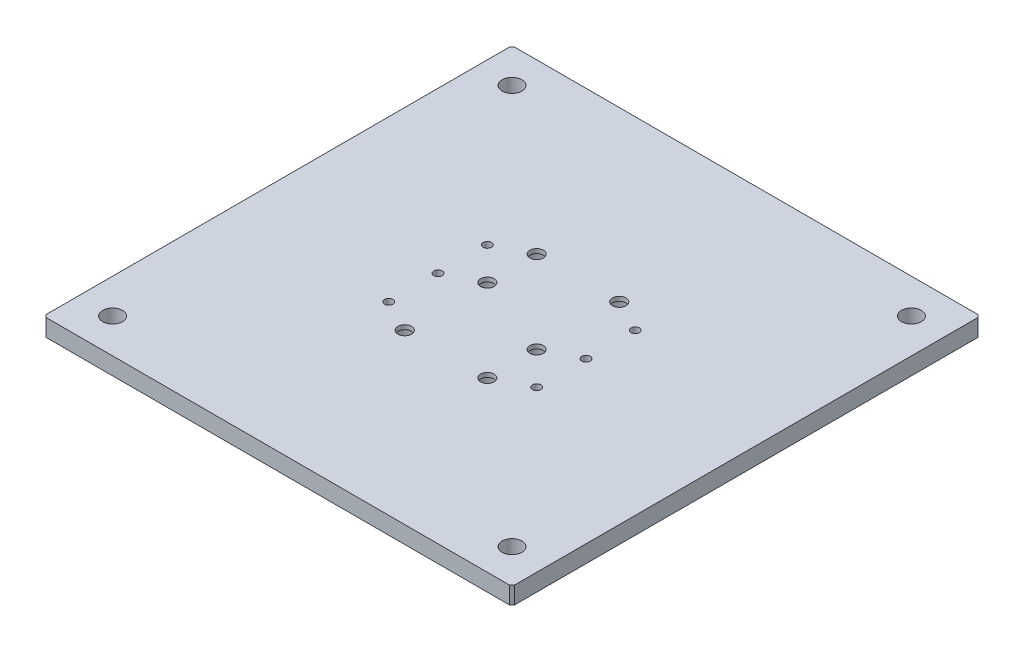
ISO-10303-21;
HEADER;
FILE_DESCRIPTION(('STEP AP214'),'2;1');
FILE_NAME('part.step','',(''),(''),'','','');
FILE_SCHEMA(('AUTOMOTIVE_DESIGN { 1 0 10303 214 1 1 1 1 }'));
ENDSEC;
DATA;
#1=APPLICATION_CONTEXT('core data for automotive mechanical design processes');
#2=APPLICATION_PROTOCOL_DEFINITION('international standard','automotive_design',2000,#1);
#3=PRODUCT_CONTEXT('',#1,'mechanical');
#4=PRODUCT('Part','Part','',(#3));
#5=PRODUCT_RELATED_PRODUCT_CATEGORY('part','',(#4));
#6=PRODUCT_DEFINITION_FORMATION('','',#4);
#7=PRODUCT_DEFINITION_CONTEXT('part definition',#1,'design');
#8=PRODUCT_DEFINITION('design','',#6,#7);
#9=PRODUCT_DEFINITION_SHAPE('','',#8);
#10=(LENGTH_UNIT() NAMED_UNIT(*) SI_UNIT(.MILLI.,.METRE.));
#11=(NAMED_UNIT(*) PLANE_ANGLE_UNIT() SI_UNIT($,.RADIAN.));
#12=(NAMED_UNIT(*) SI_UNIT($,.STERADIAN.) SOLID_ANGLE_UNIT());
#13=UNCERTAINTY_MEASURE_WITH_UNIT(LENGTH_MEASURE(1.E-05),#10,'distance_accuracy_value','');
#14=(GEOMETRIC_REPRESENTATION_CONTEXT(3) GLOBAL_UNCERTAINTY_ASSIGNED_CONTEXT((#13)) GLOBAL_UNIT_ASSIGNED_CONTEXT((#10,
#11,#12)) REPRESENTATION_CONTEXT('',''));
#15=CARTESIAN_POINT('',(0.,0.,0.));
#16=DIRECTION('',(0.,0.,1.));
#17=DIRECTION('',(1.,0.,0.));
#18=AXIS2_PLACEMENT_3D('',#15,#16,#17);
#19=CARTESIAN_POINT('',(-190.,14.,190.));
#20=DIRECTION('',(1.,0.,0.));
#21=DIRECTION('',(0.,0.,-1.));
#22=AXIS2_PLACEMENT_3D('',#19,#20,#21);
#23=PLANE('',#22);
#24=DIRECTION('',(0.,0.,1.));
#25=VECTOR('',#24,1.);
#26=CARTESIAN_POINT('',(-190.,14.,190.));
#27=LINE('',#26,#25);
#28=CARTESIAN_POINT('',(-190.,14.,-188.));
#29=VERTEX_POINT('',#28);
#30=CARTESIAN_POINT('',(-190.,14.,188.));
#31=VERTEX_POINT('',#30);
#32=EDGE_CURVE('E129',#29,#31,#27,.T.);
#33=ORIENTED_EDGE('',*,*,#32,.F.);
#34=DIRECTION('',(0.,-1.,0.));
#35=VECTOR('',#34,1.);
#36=CARTESIAN_POINT('',(-190.,14.,-188.));
#37=LINE('',#36,#35);
#38=CARTESIAN_POINT('',(-190.,0.,-188.));
#39=VERTEX_POINT('',#38);
#40=EDGE_CURVE('E11',#29,#39,#37,.T.);
#41=ORIENTED_EDGE('',*,*,#40,.T.);
#42=DIRECTION('',(0.,0.,1.));
#43=VECTOR('',#42,1.);
#44=CARTESIAN_POINT('',(-190.,0.,190.));
#45=LINE('',#44,#43);
#46=CARTESIAN_POINT('',(-190.,0.,188.));
#47=VERTEX_POINT('',#46);
#48=EDGE_CURVE('E131',#39,#47,#45,.T.);
#49=ORIENTED_EDGE('',*,*,#48,.T.);
#50=DIRECTION('',(0.,1.,0.));
#51=VECTOR('',#50,1.);
#52=CARTESIAN_POINT('',(-190.,14.,188.));
#53=LINE('',#52,#51);
#54=EDGE_CURVE('E42',#47,#31,#53,.T.);
#55=ORIENTED_EDGE('',*,*,#54,.T.);
#56=EDGE_LOOP('',(#33,#41,#49,#55));
#57=FACE_BOUND('',#56,.T.);
#58=ADVANCED_FACE('F34',(#57),#23,.F.);
#59=CARTESIAN_POINT('',(190.,14.,190.));
#60=DIRECTION('',(0.,0.,-1.));
#61=DIRECTION('',(-1.,0.,0.));
#62=AXIS2_PLACEMENT_3D('',#59,#60,#61);
#63=PLANE('',#62);
#64=DIRECTION('',(1.,0.,0.));
#65=VECTOR('',#64,1.);
#66=CARTESIAN_POINT('',(190.,0.,190.));
#67=LINE('',#66,#65);
#68=CARTESIAN_POINT('',(-188.,0.,190.));
#69=VERTEX_POINT('',#68);
#70=CARTESIAN_POINT('',(188.,0.,190.));
#71=VERTEX_POINT('',#70);
#72=EDGE_CURVE('E127',#69,#71,#67,.T.);
#73=ORIENTED_EDGE('',*,*,#72,.T.);
#74=DIRECTION('',(0.,1.,0.));
#75=VECTOR('',#74,1.);
#76=CARTESIAN_POINT('',(188.,14.,190.));
#77=LINE('',#76,#75);
#78=CARTESIAN_POINT('',(188.,14.,190.));
#79=VERTEX_POINT('',#78);
#80=EDGE_CURVE('E106',#71,#79,#77,.T.);
#81=ORIENTED_EDGE('',*,*,#80,.T.);
#82=DIRECTION('',(1.,0.,0.));
#83=VECTOR('',#82,1.);
#84=CARTESIAN_POINT('',(190.,14.,190.));
#85=LINE('',#84,#83);
#86=CARTESIAN_POINT('',(-188.,14.,190.));
#87=VERTEX_POINT('',#86);
#88=EDGE_CURVE('E167',#87,#79,#85,.T.);
#89=ORIENTED_EDGE('',*,*,#88,.F.);
#90=DIRECTION('',(0.,-1.,0.));
#91=VECTOR('',#90,1.);
#92=CARTESIAN_POINT('',(-188.,14.,190.));
#93=LINE('',#92,#91);
#94=EDGE_CURVE('E111',#87,#69,#93,.T.);
#95=ORIENTED_EDGE('',*,*,#94,.T.);
#96=EDGE_LOOP('',(#73,#81,#89,#95));
#97=FACE_BOUND('',#96,.T.);
#98=ADVANCED_FACE('F171',(#97),#63,.F.);
#99=CARTESIAN_POINT('',(190.,14.,190.));
#100=DIRECTION('',(-1.,0.,0.));
#101=DIRECTION('',(0.,0.,1.));
#102=AXIS2_PLACEMENT_3D('',#99,#100,#101);
#103=PLANE('',#102);
#104=DIRECTION('',(0.,0.,-1.));
#105=VECTOR('',#104,1.);
#106=CARTESIAN_POINT('',(190.,14.,190.));
#107=LINE('',#106,#105);
#108=CARTESIAN_POINT('',(190.,14.,188.));
#109=VERTEX_POINT('',#108);
#110=CARTESIAN_POINT('',(190.,14.,-188.));
#111=VERTEX_POINT('',#110);
#112=EDGE_CURVE('E120',#109,#111,#107,.T.);
#113=ORIENTED_EDGE('',*,*,#112,.F.);
#114=DIRECTION('',(0.,-1.,0.));
#115=VECTOR('',#114,1.);
#116=CARTESIAN_POINT('',(190.,14.,188.));
#117=LINE('',#116,#115);
#118=CARTESIAN_POINT('',(190.,0.,188.));
#119=VERTEX_POINT('',#118);
#120=EDGE_CURVE('E105',#109,#119,#117,.T.);
#121=ORIENTED_EDGE('',*,*,#120,.T.);
#122=DIRECTION('',(0.,0.,-1.));
#123=VECTOR('',#122,1.);
#124=CARTESIAN_POINT('',(190.,0.,190.));
#125=LINE('',#124,#123);
#126=CARTESIAN_POINT('',(190.,0.,-188.));
#127=VERTEX_POINT('',#126);
#128=EDGE_CURVE('E118',#119,#127,#125,.T.);
#129=ORIENTED_EDGE('',*,*,#128,.T.);
#130=DIRECTION('',(0.,1.,0.));
#131=VECTOR('',#130,1.);
#132=CARTESIAN_POINT('',(190.,14.,-188.));
#133=LINE('',#132,#131);
#134=EDGE_CURVE('E122',#127,#111,#133,.T.);
#135=ORIENTED_EDGE('',*,*,#134,.T.);
#136=EDGE_LOOP('',(#113,#121,#129,#135));
#137=FACE_BOUND('',#136,.T.);
#138=ADVANCED_FACE('F117',(#137),#103,.F.);
#139=CARTESIAN_POINT('',(190.,14.,-190.));
#140=DIRECTION('',(0.,0.,1.));
#141=DIRECTION('',(1.,0.,0.));
#142=AXIS2_PLACEMENT_3D('',#139,#140,#141);
#143=PLANE('',#142);
#144=DIRECTION('',(-1.,0.,0.));
#145=VECTOR('',#144,1.);
#146=CARTESIAN_POINT('',(190.,14.,-190.));
#147=LINE('',#146,#145);
#148=CARTESIAN_POINT('',(188.,14.,-190.));
#149=VERTEX_POINT('',#148);
#150=CARTESIAN_POINT('',(-188.,14.,-190.));
#151=VERTEX_POINT('',#150);
#152=EDGE_CURVE('E135',#149,#151,#147,.T.);
#153=ORIENTED_EDGE('',*,*,#152,.F.);
#154=DIRECTION('',(0.,-1.,0.));
#155=VECTOR('',#154,1.);
#156=CARTESIAN_POINT('',(188.,14.,-190.));
#157=LINE('',#156,#155);
#158=CARTESIAN_POINT('',(188.,0.,-190.));
#159=VERTEX_POINT('',#158);
#160=EDGE_CURVE('E152',#149,#159,#157,.T.);
#161=ORIENTED_EDGE('',*,*,#160,.T.);
#162=DIRECTION('',(-1.,0.,0.));
#163=VECTOR('',#162,1.);
#164=CARTESIAN_POINT('',(190.,0.,-190.));
#165=LINE('',#164,#163);
#166=CARTESIAN_POINT('',(-188.,0.,-190.));
#167=VERTEX_POINT('',#166);
#168=EDGE_CURVE('E126',#159,#167,#165,.T.);
#169=ORIENTED_EDGE('',*,*,#168,.T.);
#170=DIRECTION('',(0.,1.,0.));
#171=VECTOR('',#170,1.);
#172=CARTESIAN_POINT('',(-188.,14.,-190.));
#173=LINE('',#172,#171);
#174=EDGE_CURVE('E49',#167,#151,#173,.T.);
#175=ORIENTED_EDGE('',*,*,#174,.T.);
#176=EDGE_LOOP('',(#153,#161,#169,#175));
#177=FACE_BOUND('',#176,.T.);
#178=ADVANCED_FACE('F320',(#177),#143,.F.);
#179=CARTESIAN_POINT('',(0.,14.,0.));
#180=DIRECTION('',(0.,1.,0.));
#181=DIRECTION('',(0.,0.,1.));
#182=AXIS2_PLACEMENT_3D('',#179,#180,#181);
#183=PLANE('',#182);
#184=CARTESIAN_POINT('',(162.,14.,162.));
#185=DIRECTION('',(0.,1.,0.));
#186=DIRECTION('',(0.,0.,1.));
#187=AXIS2_PLACEMENT_3D('',#184,#185,#186);
#188=CIRCLE('',#187,8.00000000000001);
#189=CARTESIAN_POINT('',(162.,14.,170.));
#190=VERTEX_POINT('',#189);
#191=EDGE_CURVE('E303',#190,#190,#188,.T.);
#192=ORIENTED_EDGE('',*,*,#191,.F.);
#193=EDGE_LOOP('',(#192));
#194=FACE_BOUND('',#193,.T.);
#195=CARTESIAN_POINT('',(-162.,14.,162.));
#196=DIRECTION('',(0.,1.,0.));
#197=DIRECTION('',(0.,0.,1.));
#198=AXIS2_PLACEMENT_3D('',#195,#196,#197);
#199=CIRCLE('',#198,8.00000000000001);
#200=CARTESIAN_POINT('',(-162.,14.,170.));
#201=VERTEX_POINT('',#200);
#202=EDGE_CURVE('E297',#201,#201,#199,.T.);
#203=ORIENTED_EDGE('',*,*,#202,.F.);
#204=EDGE_LOOP('',(#203));
#205=FACE_BOUND('',#204,.T.);
#206=CARTESIAN_POINT('',(162.,14.,-162.));
#207=DIRECTION('',(0.,1.,0.));
#208=DIRECTION('',(0.,0.,1.));
#209=AXIS2_PLACEMENT_3D('',#206,#207,#208);
#210=CIRCLE('',#209,8.00000000000001);
#211=CARTESIAN_POINT('',(162.,14.,-154.));
#212=VERTEX_POINT('',#211);
#213=EDGE_CURVE('E291',#212,#212,#210,.T.);
#214=ORIENTED_EDGE('',*,*,#213,.F.);
#215=EDGE_LOOP('',(#214));
#216=FACE_BOUND('',#215,.T.);
#217=CARTESIAN_POINT('',(-162.,14.,-162.));
#218=DIRECTION('',(0.,1.,0.));
#219=DIRECTION('',(0.,0.,1.));
#220=AXIS2_PLACEMENT_3D('',#217,#218,#219);
#221=CIRCLE('',#220,8.00000000000001);
#222=CARTESIAN_POINT('',(-162.,14.,-154.));
#223=VERTEX_POINT('',#222);
#224=EDGE_CURVE('E285',#223,#223,#221,.T.);
#225=ORIENTED_EDGE('',*,*,#224,.F.);
#226=EDGE_LOOP('',(#225));
#227=FACE_BOUND('',#226,.T.);
#228=CARTESIAN_POINT('',(-33.5,14.,-53.5));
#229=DIRECTION('',(0.,-1.,0.));
#230=DIRECTION('',(0.,0.,-1.));
#231=AXIS2_PLACEMENT_3D('',#228,#229,#230);
#232=CIRCLE('',#231,5.5);
#233=CARTESIAN_POINT('',(-33.5,14.,-59.));
#234=VERTEX_POINT('',#233);
#235=EDGE_CURVE('E272',#234,#234,#232,.T.);
#236=ORIENTED_EDGE('',*,*,#235,.T.);
#237=EDGE_LOOP('',(#236));
#238=FACE_BOUND('',#237,.T.);
#239=CARTESIAN_POINT('',(33.5,14.,13.5));
#240=DIRECTION('',(0.,-1.,0.));
#241=DIRECTION('',(0.,0.,-1.));
#242=AXIS2_PLACEMENT_3D('',#239,#240,#241);
#243=CIRCLE('',#242,5.5);
#244=CARTESIAN_POINT('',(33.5,14.,8.));
#245=VERTEX_POINT('',#244);
#246=EDGE_CURVE('E260',#245,#245,#243,.T.);
#247=ORIENTED_EDGE('',*,*,#246,.T.);
#248=EDGE_LOOP('',(#247));
#249=FACE_BOUND('',#248,.T.);
#250=CARTESIAN_POINT('',(-33.5,14.,53.5));
#251=DIRECTION('',(0.,-1.,0.));
#252=DIRECTION('',(0.,0.,-1.));
#253=AXIS2_PLACEMENT_3D('',#250,#251,#252);
#254=CIRCLE('',#253,5.5);
#255=CARTESIAN_POINT('',(-33.5,14.,48.));
#256=VERTEX_POINT('',#255);
#257=EDGE_CURVE('E248',#256,#256,#254,.T.);
#258=ORIENTED_EDGE('',*,*,#257,.T.);
#259=EDGE_LOOP('',(#258));
#260=FACE_BOUND('',#259,.T.);
#261=CARTESIAN_POINT('',(33.5,14.,-53.5));
#262=DIRECTION('',(0.,-1.,0.));
#263=DIRECTION('',(0.,0.,-1.));
#264=AXIS2_PLACEMENT_3D('',#261,#262,#263);
#265=CIRCLE('',#264,5.5);
#266=CARTESIAN_POINT('',(33.5,14.,-59.));
#267=VERTEX_POINT('',#266);
#268=EDGE_CURVE('E236',#267,#267,#265,.T.);
#269=ORIENTED_EDGE('',*,*,#268,.T.);
#270=EDGE_LOOP('',(#269));
#271=FACE_BOUND('',#270,.T.);
#272=CARTESIAN_POINT('',(33.5,14.,53.5));
#273=DIRECTION('',(0.,-1.,0.));
#274=DIRECTION('',(0.,0.,-1.));
#275=AXIS2_PLACEMENT_3D('',#272,#273,#274);
#276=CIRCLE('',#275,5.5);
#277=CARTESIAN_POINT('',(33.5,14.,48.));
#278=VERTEX_POINT('',#277);
#279=EDGE_CURVE('E224',#278,#278,#276,.T.);
#280=ORIENTED_EDGE('',*,*,#279,.T.);
#281=EDGE_LOOP('',(#280));
#282=FACE_BOUND('',#281,.T.);
#283=CARTESIAN_POINT('',(-33.5,14.,-13.5));
#284=DIRECTION('',(0.,-1.,0.));
#285=DIRECTION('',(0.,0.,-1.));
#286=AXIS2_PLACEMENT_3D('',#283,#284,#285);
#287=CIRCLE('',#286,5.5);
#288=CARTESIAN_POINT('',(-33.5,14.,-19.));
#289=VERTEX_POINT('',#288);
#290=EDGE_CURVE('E212',#289,#289,#287,.T.);
#291=ORIENTED_EDGE('',*,*,#290,.T.);
#292=EDGE_LOOP('',(#291));
#293=FACE_BOUND('',#292,.T.);
#294=CARTESIAN_POINT('',(-60.,14.,-40.));
#295=DIRECTION('',(0.,1.,0.));
#296=DIRECTION('',(0.,0.,1.));
#297=AXIS2_PLACEMENT_3D('',#294,#295,#296);
#298=CIRCLE('',#297,3.4);
#299=CARTESIAN_POINT('',(-60.,14.,-36.6));
#300=VERTEX_POINT('',#299);
#301=EDGE_CURVE('E209',#300,#300,#298,.T.);
#302=ORIENTED_EDGE('',*,*,#301,.F.);
#303=EDGE_LOOP('',(#302));
#304=FACE_BOUND('',#303,.T.);
#305=CARTESIAN_POINT('',(-60.,14.,0.));
#306=DIRECTION('',(0.,1.,0.));
#307=DIRECTION('',(0.,0.,1.));
#308=AXIS2_PLACEMENT_3D('',#305,#306,#307);
#309=CIRCLE('',#308,3.4);
#310=CARTESIAN_POINT('',(-60.,14.,3.4));
#311=VERTEX_POINT('',#310);
#312=EDGE_CURVE('E203',#311,#311,#309,.T.);
#313=ORIENTED_EDGE('',*,*,#312,.F.);
#314=EDGE_LOOP('',(#313));
#315=FACE_BOUND('',#314,.T.);
#316=CARTESIAN_POINT('',(-60.,14.,40.));
#317=DIRECTION('',(0.,1.,0.));
#318=DIRECTION('',(0.,0.,1.));
#319=AXIS2_PLACEMENT_3D('',#316,#317,#318);
#320=CIRCLE('',#319,3.4);
#321=CARTESIAN_POINT('',(-60.,14.,43.4));
#322=VERTEX_POINT('',#321);
#323=EDGE_CURVE('E197',#322,#322,#320,.T.);
#324=ORIENTED_EDGE('',*,*,#323,.F.);
#325=EDGE_LOOP('',(#324));
#326=FACE_BOUND('',#325,.T.);
#327=CARTESIAN_POINT('',(60.,14.,-40.));
#328=DIRECTION('',(0.,1.,0.));
#329=DIRECTION('',(0.,0.,1.));
#330=AXIS2_PLACEMENT_3D('',#327,#328,#329);
#331=CIRCLE('',#330,3.4);
#332=CARTESIAN_POINT('',(60.,14.,-36.6));
#333=VERTEX_POINT('',#332);
#334=EDGE_CURVE('E191',#333,#333,#331,.T.);
#335=ORIENTED_EDGE('',*,*,#334,.F.);
#336=EDGE_LOOP('',(#335));
#337=FACE_BOUND('',#336,.T.);
#338=CARTESIAN_POINT('',(60.,14.,0.));
#339=DIRECTION('',(0.,1.,0.));
#340=DIRECTION('',(0.,0.,1.));
#341=AXIS2_PLACEMENT_3D('',#338,#339,#340);
#342=CIRCLE('',#341,3.39999999999999);
#343=CARTESIAN_POINT('',(60.,14.,3.39999999999999));
#344=VERTEX_POINT('',#343);
#345=EDGE_CURVE('E185',#344,#344,#342,.T.);
#346=ORIENTED_EDGE('',*,*,#345,.F.);
#347=EDGE_LOOP('',(#346));
#348=FACE_BOUND('',#347,.T.);
#349=CARTESIAN_POINT('',(60.,14.,40.));
#350=DIRECTION('',(0.,1.,0.));
#351=DIRECTION('',(0.,0.,1.));
#352=AXIS2_PLACEMENT_3D('',#349,#350,#351);
#353=CIRCLE('',#352,3.4);
#354=CARTESIAN_POINT('',(60.,14.,43.4));
#355=VERTEX_POINT('',#354);
#356=EDGE_CURVE('E174',#355,#355,#353,.T.);
#357=ORIENTED_EDGE('',*,*,#356,.F.);
#358=EDGE_LOOP('',(#357));
#359=FACE_BOUND('',#358,.T.);
#360=ORIENTED_EDGE('',*,*,#88,.T.);
#361=DIRECTION('',(-0.707106781186548,0.,0.707106781186548));
#362=VECTOR('',#361,1.);
#363=CARTESIAN_POINT('',(189.,14.,189.));
#364=LINE('',#363,#362);
#365=EDGE_CURVE('E149',#79,#109,#364,.F.);
#366=ORIENTED_EDGE('',*,*,#365,.T.);
#367=ORIENTED_EDGE('',*,*,#112,.T.);
#368=DIRECTION('',(0.707106781186548,0.,0.707106781186548));
#369=VECTOR('',#368,1.);
#370=CARTESIAN_POINT('',(189.,14.,-189.));
#371=LINE('',#370,#369);
#372=EDGE_CURVE('E56',#111,#149,#371,.F.);
#373=ORIENTED_EDGE('',*,*,#372,.T.);
#374=ORIENTED_EDGE('',*,*,#152,.T.);
#375=DIRECTION('',(0.707106781186548,0.,-0.707106781186548));
#376=VECTOR('',#375,1.);
#377=CARTESIAN_POINT('',(-189.,14.,-189.));
#378=LINE('',#377,#376);
#379=EDGE_CURVE('E146',#151,#29,#378,.F.);
#380=ORIENTED_EDGE('',*,*,#379,.T.);
#381=ORIENTED_EDGE('',*,*,#32,.T.);
#382=DIRECTION('',(-0.707106781186548,0.,-0.707106781186548));
#383=VECTOR('',#382,1.);
#384=CARTESIAN_POINT('',(-189.,14.,189.));
#385=LINE('',#384,#383);
#386=EDGE_CURVE('E144',#31,#87,#385,.F.);
#387=ORIENTED_EDGE('',*,*,#386,.T.);
#388=EDGE_LOOP('',(#360,#366,#367,#373,#374,#380,#381,#387));
#389=FACE_BOUND('',#388,.T.);
#390=ADVANCED_FACE('F164',(#194,#205,#216,#227,#238,#249,#260,#271,#282,#293,#304,#315,#326,
#337,#348,#359,#389),#183,.T.);
#391=CARTESIAN_POINT('',(0.,0.,0.));
#392=DIRECTION('',(0.,1.,0.));
#393=DIRECTION('',(0.,0.,1.));
#394=AXIS2_PLACEMENT_3D('',#391,#392,#393);
#395=PLANE('',#394);
#396=CARTESIAN_POINT('',(162.,0.,162.));
#397=DIRECTION('',(0.,1.,0.));
#398=DIRECTION('',(0.,0.,1.));
#399=AXIS2_PLACEMENT_3D('',#396,#397,#398);
#400=CIRCLE('',#399,8.00000000000001);
#401=CARTESIAN_POINT('',(162.,0.,170.));
#402=VERTEX_POINT('',#401);
#403=EDGE_CURVE('E300',#402,#402,#400,.T.);
#404=ORIENTED_EDGE('',*,*,#403,.T.);
#405=EDGE_LOOP('',(#404));
#406=FACE_BOUND('',#405,.T.);
#407=CARTESIAN_POINT('',(-162.,0.,162.));
#408=DIRECTION('',(0.,1.,0.));
#409=DIRECTION('',(0.,0.,1.));
#410=AXIS2_PLACEMENT_3D('',#407,#408,#409);
#411=CIRCLE('',#410,8.00000000000001);
#412=CARTESIAN_POINT('',(-162.,0.,170.));
#413=VERTEX_POINT('',#412);
#414=EDGE_CURVE('E294',#413,#413,#411,.T.);
#415=ORIENTED_EDGE('',*,*,#414,.T.);
#416=EDGE_LOOP('',(#415));
#417=FACE_BOUND('',#416,.T.);
#418=CARTESIAN_POINT('',(162.,0.,-162.));
#419=DIRECTION('',(0.,1.,0.));
#420=DIRECTION('',(0.,0.,1.));
#421=AXIS2_PLACEMENT_3D('',#418,#419,#420);
#422=CIRCLE('',#421,8.00000000000001);
#423=CARTESIAN_POINT('',(162.,0.,-154.));
#424=VERTEX_POINT('',#423);
#425=EDGE_CURVE('E288',#424,#424,#422,.T.);
#426=ORIENTED_EDGE('',*,*,#425,.T.);
#427=EDGE_LOOP('',(#426));
#428=FACE_BOUND('',#427,.T.);
#429=CARTESIAN_POINT('',(-162.,0.,-162.));
#430=DIRECTION('',(0.,1.,0.));
#431=DIRECTION('',(0.,0.,1.));
#432=AXIS2_PLACEMENT_3D('',#429,#430,#431);
#433=CIRCLE('',#432,8.00000000000001);
#434=CARTESIAN_POINT('',(-162.,0.,-154.));
#435=VERTEX_POINT('',#434);
#436=EDGE_CURVE('E284',#435,#435,#433,.T.);
#437=ORIENTED_EDGE('',*,*,#436,.T.);
#438=EDGE_LOOP('',(#437));
#439=FACE_BOUND('',#438,.T.);
#440=CARTESIAN_POINT('',(-33.5,0.,-53.5));
#441=DIRECTION('',(0.,-1.,0.));
#442=DIRECTION('',(0.,0.,-1.));
#443=AXIS2_PLACEMENT_3D('',#440,#441,#442);
#444=CIRCLE('',#443,11.);
#445=CARTESIAN_POINT('',(-33.5,0.,-64.5));
#446=VERTEX_POINT('',#445);
#447=EDGE_CURVE('E281',#446,#446,#444,.T.);
#448=ORIENTED_EDGE('',*,*,#447,.F.);
#449=EDGE_LOOP('',(#448));
#450=FACE_BOUND('',#449,.T.);
#451=CARTESIAN_POINT('',(33.5,0.,13.5));
#452=DIRECTION('',(0.,-1.,0.));
#453=DIRECTION('',(0.,0.,-1.));
#454=AXIS2_PLACEMENT_3D('',#451,#452,#453);
#455=CIRCLE('',#454,11.);
#456=CARTESIAN_POINT('',(33.5,0.,2.5));
#457=VERTEX_POINT('',#456);
#458=EDGE_CURVE('E269',#457,#457,#455,.T.);
#459=ORIENTED_EDGE('',*,*,#458,.F.);
#460=EDGE_LOOP('',(#459));
#461=FACE_BOUND('',#460,.T.);
#462=CARTESIAN_POINT('',(-33.5,0.,53.5));
#463=DIRECTION('',(0.,-1.,0.));
#464=DIRECTION('',(0.,0.,-1.));
#465=AXIS2_PLACEMENT_3D('',#462,#463,#464);
#466=CIRCLE('',#465,11.);
#467=CARTESIAN_POINT('',(-33.5,0.,42.5));
#468=VERTEX_POINT('',#467);
#469=EDGE_CURVE('E257',#468,#468,#466,.T.);
#470=ORIENTED_EDGE('',*,*,#469,.F.);
#471=EDGE_LOOP('',(#470));
#472=FACE_BOUND('',#471,.T.);
#473=CARTESIAN_POINT('',(33.5,0.,-53.5));
#474=DIRECTION('',(0.,-1.,0.));
#475=DIRECTION('',(0.,0.,-1.));
#476=AXIS2_PLACEMENT_3D('',#473,#474,#475);
#477=CIRCLE('',#476,11.);
#478=CARTESIAN_POINT('',(33.5,0.,-64.5));
#479=VERTEX_POINT('',#478);
#480=EDGE_CURVE('E245',#479,#479,#477,.T.);
#481=ORIENTED_EDGE('',*,*,#480,.F.);
#482=EDGE_LOOP('',(#481));
#483=FACE_BOUND('',#482,.T.);
#484=CARTESIAN_POINT('',(33.5,0.,53.5));
#485=DIRECTION('',(0.,-1.,0.));
#486=DIRECTION('',(0.,0.,-1.));
#487=AXIS2_PLACEMENT_3D('',#484,#485,#486);
#488=CIRCLE('',#487,11.);
#489=CARTESIAN_POINT('',(33.5,0.,42.5));
#490=VERTEX_POINT('',#489);
#491=EDGE_CURVE('E233',#490,#490,#488,.T.);
#492=ORIENTED_EDGE('',*,*,#491,.F.);
#493=EDGE_LOOP('',(#492));
#494=FACE_BOUND('',#493,.T.);
#495=CARTESIAN_POINT('',(-33.5,0.,-13.5));
#496=DIRECTION('',(0.,-1.,0.));
#497=DIRECTION('',(0.,0.,-1.));
#498=AXIS2_PLACEMENT_3D('',#495,#496,#497);
#499=CIRCLE('',#498,11.);
#500=CARTESIAN_POINT('',(-33.5,0.,-24.5));
#501=VERTEX_POINT('',#500);
#502=EDGE_CURVE('E221',#501,#501,#499,.T.);
#503=ORIENTED_EDGE('',*,*,#502,.F.);
#504=EDGE_LOOP('',(#503));
#505=FACE_BOUND('',#504,.T.);
#506=CARTESIAN_POINT('',(-60.,0.,-40.));
#507=DIRECTION('',(0.,1.,0.));
#508=DIRECTION('',(0.,0.,1.));
#509=AXIS2_PLACEMENT_3D('',#506,#507,#508);
#510=CIRCLE('',#509,3.4);
#511=CARTESIAN_POINT('',(-60.,0.,-36.6));
#512=VERTEX_POINT('',#511);
#513=EDGE_CURVE('E206',#512,#512,#510,.T.);
#514=ORIENTED_EDGE('',*,*,#513,.T.);
#515=EDGE_LOOP('',(#514));
#516=FACE_BOUND('',#515,.T.);
#517=CARTESIAN_POINT('',(-60.,0.,0.));
#518=DIRECTION('',(0.,1.,0.));
#519=DIRECTION('',(0.,0.,1.));
#520=AXIS2_PLACEMENT_3D('',#517,#518,#519);
#521=CIRCLE('',#520,3.39999999999999);
#522=CARTESIAN_POINT('',(-60.,0.,3.39999999999999));
#523=VERTEX_POINT('',#522);
#524=EDGE_CURVE('E200',#523,#523,#521,.T.);
#525=ORIENTED_EDGE('',*,*,#524,.T.);
#526=EDGE_LOOP('',(#525));
#527=FACE_BOUND('',#526,.T.);
#528=CARTESIAN_POINT('',(-60.,0.,40.));
#529=DIRECTION('',(0.,1.,0.));
#530=DIRECTION('',(0.,0.,1.));
#531=AXIS2_PLACEMENT_3D('',#528,#529,#530);
#532=CIRCLE('',#531,3.4);
#533=CARTESIAN_POINT('',(-60.,0.,43.4));
#534=VERTEX_POINT('',#533);
#535=EDGE_CURVE('E194',#534,#534,#532,.T.);
#536=ORIENTED_EDGE('',*,*,#535,.T.);
#537=EDGE_LOOP('',(#536));
#538=FACE_BOUND('',#537,.T.);
#539=CARTESIAN_POINT('',(60.,0.,-40.));
#540=DIRECTION('',(0.,1.,0.));
#541=DIRECTION('',(0.,0.,1.));
#542=AXIS2_PLACEMENT_3D('',#539,#540,#541);
#543=CIRCLE('',#542,3.4);
#544=CARTESIAN_POINT('',(60.,0.,-36.6));
#545=VERTEX_POINT('',#544);
#546=EDGE_CURVE('E188',#545,#545,#543,.T.);
#547=ORIENTED_EDGE('',*,*,#546,.T.);
#548=EDGE_LOOP('',(#547));
#549=FACE_BOUND('',#548,.T.);
#550=CARTESIAN_POINT('',(60.,0.,0.));
#551=DIRECTION('',(0.,1.,0.));
#552=DIRECTION('',(0.,0.,1.));
#553=AXIS2_PLACEMENT_3D('',#550,#551,#552);
#554=CIRCLE('',#553,3.39999999999999);
#555=CARTESIAN_POINT('',(60.,0.,3.39999999999999));
#556=VERTEX_POINT('',#555);
#557=EDGE_CURVE('E182',#556,#556,#554,.T.);
#558=ORIENTED_EDGE('',*,*,#557,.T.);
#559=EDGE_LOOP('',(#558));
#560=FACE_BOUND('',#559,.T.);
#561=CARTESIAN_POINT('',(60.,0.,40.));
#562=DIRECTION('',(0.,1.,0.));
#563=DIRECTION('',(0.,0.,1.));
#564=AXIS2_PLACEMENT_3D('',#561,#562,#563);
#565=CIRCLE('',#564,3.4);
#566=CARTESIAN_POINT('',(60.,0.,43.4));
#567=VERTEX_POINT('',#566);
#568=EDGE_CURVE('E172',#567,#567,#565,.T.);
#569=ORIENTED_EDGE('',*,*,#568,.T.);
#570=EDGE_LOOP('',(#569));
#571=FACE_BOUND('',#570,.T.);
#572=ORIENTED_EDGE('',*,*,#128,.F.);
#573=DIRECTION('',(0.707106781186548,0.,-0.707106781186548));
#574=VECTOR('',#573,1.);
#575=CARTESIAN_POINT('',(190.,0.,188.));
#576=LINE('',#575,#574);
#577=EDGE_CURVE('E101',#119,#71,#576,.F.);
#578=ORIENTED_EDGE('',*,*,#577,.T.);
#579=ORIENTED_EDGE('',*,*,#72,.F.);
#580=DIRECTION('',(0.707106781186548,0.,0.707106781186548));
#581=VECTOR('',#580,1.);
#582=CARTESIAN_POINT('',(-188.,0.,190.));
#583=LINE('',#582,#581);
#584=EDGE_CURVE('E121',#69,#47,#583,.F.);
#585=ORIENTED_EDGE('',*,*,#584,.T.);
#586=ORIENTED_EDGE('',*,*,#48,.F.);
#587=DIRECTION('',(-0.707106781186548,0.,0.707106781186548));
#588=VECTOR('',#587,1.);
#589=CARTESIAN_POINT('',(-190.,0.,-188.));
#590=LINE('',#589,#588);
#591=EDGE_CURVE('E138',#39,#167,#590,.F.);
#592=ORIENTED_EDGE('',*,*,#591,.T.);
#593=ORIENTED_EDGE('',*,*,#168,.F.);
#594=DIRECTION('',(-0.707106781186548,0.,-0.707106781186548));
#595=VECTOR('',#594,1.);
#596=CARTESIAN_POINT('',(188.,0.,-190.));
#597=LINE('',#596,#595);
#598=EDGE_CURVE('E112',#159,#127,#597,.F.);
#599=ORIENTED_EDGE('',*,*,#598,.T.);
#600=EDGE_LOOP('',(#572,#578,#579,#585,#586,#592,#593,#599));
#601=FACE_BOUND('',#600,.T.);
#602=ADVANCED_FACE('F124',(#406,#417,#428,#439,#450,#461,#472,#483,#494,#505,#516,#527,#538,
#549,#560,#571,#601),#395,.F.);
#603=CARTESIAN_POINT('',(190.,14.,188.));
#604=DIRECTION('',(-0.707106781186547,0.,-0.707106781186547));
#605=DIRECTION('',(0.,-1.,0.));
#606=AXIS2_PLACEMENT_3D('',#603,#604,#605);
#607=PLANE('',#606);
#608=ORIENTED_EDGE('',*,*,#365,.F.);
#609=ORIENTED_EDGE('',*,*,#80,.F.);
#610=ORIENTED_EDGE('',*,*,#577,.F.);
#611=ORIENTED_EDGE('',*,*,#120,.F.);
#612=EDGE_LOOP('',(#608,#609,#610,#611));
#613=FACE_BOUND('',#612,.T.);
#614=ADVANCED_FACE('F104',(#613),#607,.F.);
#615=CARTESIAN_POINT('',(188.,14.,-190.));
#616=DIRECTION('',(-0.707106781186548,0.,0.707106781186548));
#617=DIRECTION('',(0.,-1.,0.));
#618=AXIS2_PLACEMENT_3D('',#615,#616,#617);
#619=PLANE('',#618);
#620=ORIENTED_EDGE('',*,*,#372,.F.);
#621=ORIENTED_EDGE('',*,*,#134,.F.);
#622=ORIENTED_EDGE('',*,*,#598,.F.);
#623=ORIENTED_EDGE('',*,*,#160,.F.);
#624=EDGE_LOOP('',(#620,#621,#622,#623));
#625=FACE_BOUND('',#624,.T.);
#626=ADVANCED_FACE('F376',(#625),#619,.F.);
#627=CARTESIAN_POINT('',(-190.,14.,-188.));
#628=DIRECTION('',(0.707106781186548,0.,0.707106781186548));
#629=DIRECTION('',(0.,-1.,0.));
#630=AXIS2_PLACEMENT_3D('',#627,#628,#629);
#631=PLANE('',#630);
#632=ORIENTED_EDGE('',*,*,#379,.F.);
#633=ORIENTED_EDGE('',*,*,#174,.F.);
#634=ORIENTED_EDGE('',*,*,#591,.F.);
#635=ORIENTED_EDGE('',*,*,#40,.F.);
#636=EDGE_LOOP('',(#632,#633,#634,#635));
#637=FACE_BOUND('',#636,.T.);
#638=ADVANCED_FACE('F364',(#637),#631,.F.);
#639=CARTESIAN_POINT('',(-188.,14.,190.));
#640=DIRECTION('',(0.707106781186548,0.,-0.707106781186548));
#641=DIRECTION('',(0.,-1.,0.));
#642=AXIS2_PLACEMENT_3D('',#639,#640,#641);
#643=PLANE('',#642);
#644=ORIENTED_EDGE('',*,*,#386,.F.);
#645=ORIENTED_EDGE('',*,*,#54,.F.);
#646=ORIENTED_EDGE('',*,*,#584,.F.);
#647=ORIENTED_EDGE('',*,*,#94,.F.);
#648=EDGE_LOOP('',(#644,#645,#646,#647));
#649=FACE_BOUND('',#648,.T.);
#650=ADVANCED_FACE('F36',(#649),#643,.F.);
#651=CARTESIAN_POINT('',(60.,14.,40.));
#652=DIRECTION('',(0.,1.,0.));
#653=DIRECTION('',(0.,0.,1.));
#654=AXIS2_PLACEMENT_3D('',#651,#652,#653);
#655=CYLINDRICAL_SURFACE('',#654,3.4);
#656=ORIENTED_EDGE('',*,*,#568,.F.);
#657=EDGE_LOOP('',(#656));
#658=FACE_BOUND('',#657,.T.);
#659=ORIENTED_EDGE('',*,*,#356,.T.);
#660=EDGE_LOOP('',(#659));
#661=FACE_BOUND('',#660,.T.);
#662=ADVANCED_FACE('F352',(#658,#661),#655,.F.);
#663=CARTESIAN_POINT('',(60.,14.,0.));
#664=DIRECTION('',(0.,1.,0.));
#665=DIRECTION('',(0.,0.,1.));
#666=AXIS2_PLACEMENT_3D('',#663,#664,#665);
#667=CYLINDRICAL_SURFACE('',#666,3.39999999999999);
#668=ORIENTED_EDGE('',*,*,#557,.F.);
#669=EDGE_LOOP('',(#668));
#670=FACE_BOUND('',#669,.T.);
#671=ORIENTED_EDGE('',*,*,#345,.T.);
#672=EDGE_LOOP('',(#671));
#673=FACE_BOUND('',#672,.T.);
#674=ADVANCED_FACE('F354',(#670,#673),#667,.F.);
#675=CARTESIAN_POINT('',(60.,14.,-40.));
#676=DIRECTION('',(0.,1.,0.));
#677=DIRECTION('',(0.,0.,1.));
#678=AXIS2_PLACEMENT_3D('',#675,#676,#677);
#679=CYLINDRICAL_SURFACE('',#678,3.4);
#680=ORIENTED_EDGE('',*,*,#546,.F.);
#681=EDGE_LOOP('',(#680));
#682=FACE_BOUND('',#681,.T.);
#683=ORIENTED_EDGE('',*,*,#334,.T.);
#684=EDGE_LOOP('',(#683));
#685=FACE_BOUND('',#684,.T.);
#686=ADVANCED_FACE('F361',(#682,#685),#679,.F.);
#687=CARTESIAN_POINT('',(-60.,14.,40.));
#688=DIRECTION('',(0.,1.,0.));
#689=DIRECTION('',(0.,0.,1.));
#690=AXIS2_PLACEMENT_3D('',#687,#688,#689);
#691=CYLINDRICAL_SURFACE('',#690,3.4);
#692=ORIENTED_EDGE('',*,*,#535,.F.);
#693=EDGE_LOOP('',(#692));
#694=FACE_BOUND('',#693,.T.);
#695=ORIENTED_EDGE('',*,*,#323,.T.);
#696=EDGE_LOOP('',(#695));
#697=FACE_BOUND('',#696,.T.);
#698=ADVANCED_FACE('F408',(#694,#697),#691,.F.);
#699=CARTESIAN_POINT('',(-60.,14.,0.));
#700=DIRECTION('',(0.,1.,0.));
#701=DIRECTION('',(0.,0.,1.));
#702=AXIS2_PLACEMENT_3D('',#699,#700,#701);
#703=CYLINDRICAL_SURFACE('',#702,3.4);
#704=ORIENTED_EDGE('',*,*,#524,.F.);
#705=EDGE_LOOP('',(#704));
#706=FACE_BOUND('',#705,.T.);
#707=ORIENTED_EDGE('',*,*,#312,.T.);
#708=EDGE_LOOP('',(#707));
#709=FACE_BOUND('',#708,.T.);
#710=ADVANCED_FACE('F418',(#706,#709),#703,.F.);
#711=CARTESIAN_POINT('',(-60.,14.,-40.));
#712=DIRECTION('',(0.,1.,0.));
#713=DIRECTION('',(0.,0.,1.));
#714=AXIS2_PLACEMENT_3D('',#711,#712,#713);
#715=CYLINDRICAL_SURFACE('',#714,3.4);
#716=ORIENTED_EDGE('',*,*,#513,.F.);
#717=EDGE_LOOP('',(#716));
#718=FACE_BOUND('',#717,.T.);
#719=ORIENTED_EDGE('',*,*,#301,.T.);
#720=EDGE_LOOP('',(#719));
#721=FACE_BOUND('',#720,.T.);
#722=ADVANCED_FACE('F428',(#718,#721),#715,.F.);
#723=CARTESIAN_POINT('',(-33.5,0.,-13.5));
#724=DIRECTION('',(0.,-1.,0.));
#725=DIRECTION('',(0.,0.,-1.));
#726=AXIS2_PLACEMENT_3D('',#723,#724,#725);
#727=CYLINDRICAL_SURFACE('',#726,5.5);
#728=ORIENTED_EDGE('',*,*,#290,.F.);
#729=EDGE_LOOP('',(#728));
#730=FACE_BOUND('',#729,.T.);
#731=CARTESIAN_POINT('',(-33.5,10.5,-13.5));
#732=DIRECTION('',(0.,-1.,0.));
#733=DIRECTION('',(0.,0.,-1.));
#734=AXIS2_PLACEMENT_3D('',#731,#732,#733);
#735=CIRCLE('',#734,5.5);
#736=CARTESIAN_POINT('',(-33.5,10.5,-19.));
#737=VERTEX_POINT('',#736);
#738=EDGE_CURVE('E215',#737,#737,#735,.T.);
#739=ORIENTED_EDGE('',*,*,#738,.T.);
#740=EDGE_LOOP('',(#739));
#741=FACE_BOUND('',#740,.T.);
#742=ADVANCED_FACE('F438',(#730,#741),#727,.F.);
#743=CARTESIAN_POINT('',(-28.,10.5,-13.5));
#744=DIRECTION('',(0.,1.,0.));
#745=DIRECTION('',(0.,0.,1.));
#746=AXIS2_PLACEMENT_3D('',#743,#744,#745);
#747=PLANE('',#746);
#748=ORIENTED_EDGE('',*,*,#738,.F.);
#749=EDGE_LOOP('',(#748));
#750=FACE_BOUND('',#749,.T.);
#751=CARTESIAN_POINT('',(-33.5,10.5,-13.5));
#752=DIRECTION('',(0.,-1.,0.));
#753=DIRECTION('',(0.,0.,-1.));
#754=AXIS2_PLACEMENT_3D('',#751,#752,#753);
#755=CIRCLE('',#754,11.);
#756=CARTESIAN_POINT('',(-33.5,10.5,-24.5));
#757=VERTEX_POINT('',#756);
#758=EDGE_CURVE('E218',#757,#757,#755,.T.);
#759=ORIENTED_EDGE('',*,*,#758,.T.);
#760=EDGE_LOOP('',(#759));
#761=FACE_BOUND('',#760,.T.);
#762=ADVANCED_FACE('F448',(#750,#761),#747,.F.);
#763=CARTESIAN_POINT('',(-33.5,0.,-13.5));
#764=DIRECTION('',(0.,-1.,0.));
#765=DIRECTION('',(0.,0.,-1.));
#766=AXIS2_PLACEMENT_3D('',#763,#764,#765);
#767=CYLINDRICAL_SURFACE('',#766,11.);
#768=ORIENTED_EDGE('',*,*,#758,.F.);
#769=EDGE_LOOP('',(#768));
#770=FACE_BOUND('',#769,.T.);
#771=ORIENTED_EDGE('',*,*,#502,.T.);
#772=EDGE_LOOP('',(#771));
#773=FACE_BOUND('',#772,.T.);
#774=ADVANCED_FACE('F458',(#770,#773),#767,.F.);
#775=CARTESIAN_POINT('',(33.5,0.,53.5));
#776=DIRECTION('',(0.,-1.,0.));
#777=DIRECTION('',(0.,0.,-1.));
#778=AXIS2_PLACEMENT_3D('',#775,#776,#777);
#779=CYLINDRICAL_SURFACE('',#778,5.5);
#780=ORIENTED_EDGE('',*,*,#279,.F.);
#781=EDGE_LOOP('',(#780));
#782=FACE_BOUND('',#781,.T.);
#783=CARTESIAN_POINT('',(33.5,10.5,53.5));
#784=DIRECTION('',(0.,-1.,0.));
#785=DIRECTION('',(0.,0.,-1.));
#786=AXIS2_PLACEMENT_3D('',#783,#784,#785);
#787=CIRCLE('',#786,5.5);
#788=CARTESIAN_POINT('',(33.5,10.5,48.));
#789=VERTEX_POINT('',#788);
#790=EDGE_CURVE('E227',#789,#789,#787,.T.);
#791=ORIENTED_EDGE('',*,*,#790,.T.);
#792=EDGE_LOOP('',(#791));
#793=FACE_BOUND('',#792,.T.);
#794=ADVANCED_FACE('F468',(#782,#793),#779,.F.);
#795=CARTESIAN_POINT('',(39.,10.5,53.5));
#796=DIRECTION('',(0.,1.,0.));
#797=DIRECTION('',(0.,0.,1.));
#798=AXIS2_PLACEMENT_3D('',#795,#796,#797);
#799=PLANE('',#798);
#800=ORIENTED_EDGE('',*,*,#790,.F.);
#801=EDGE_LOOP('',(#800));
#802=FACE_BOUND('',#801,.T.);
#803=CARTESIAN_POINT('',(33.5,10.5,53.5));
#804=DIRECTION('',(0.,-1.,0.));
#805=DIRECTION('',(0.,0.,-1.));
#806=AXIS2_PLACEMENT_3D('',#803,#804,#805);
#807=CIRCLE('',#806,11.);
#808=CARTESIAN_POINT('',(33.5,10.5,42.5));
#809=VERTEX_POINT('',#808);
#810=EDGE_CURVE('E230',#809,#809,#807,.T.);
#811=ORIENTED_EDGE('',*,*,#810,.T.);
#812=EDGE_LOOP('',(#811));
#813=FACE_BOUND('',#812,.T.);
#814=ADVANCED_FACE('F478',(#802,#813),#799,.F.);
#815=CARTESIAN_POINT('',(33.5,0.,53.5));
#816=DIRECTION('',(0.,-1.,0.));
#817=DIRECTION('',(0.,0.,-1.));
#818=AXIS2_PLACEMENT_3D('',#815,#816,#817);
#819=CYLINDRICAL_SURFACE('',#818,11.);
#820=ORIENTED_EDGE('',*,*,#810,.F.);
#821=EDGE_LOOP('',(#820));
#822=FACE_BOUND('',#821,.T.);
#823=ORIENTED_EDGE('',*,*,#491,.T.);
#824=EDGE_LOOP('',(#823));
#825=FACE_BOUND('',#824,.T.);
#826=ADVANCED_FACE('F488',(#822,#825),#819,.F.);
#827=CARTESIAN_POINT('',(33.5,0.,-53.5));
#828=DIRECTION('',(0.,-1.,0.));
#829=DIRECTION('',(0.,0.,-1.));
#830=AXIS2_PLACEMENT_3D('',#827,#828,#829);
#831=CYLINDRICAL_SURFACE('',#830,5.5);
#832=ORIENTED_EDGE('',*,*,#268,.F.);
#833=EDGE_LOOP('',(#832));
#834=FACE_BOUND('',#833,.T.);
#835=CARTESIAN_POINT('',(33.5,10.5,-53.5));
#836=DIRECTION('',(0.,-1.,0.));
#837=DIRECTION('',(0.,0.,-1.));
#838=AXIS2_PLACEMENT_3D('',#835,#836,#837);
#839=CIRCLE('',#838,5.5);
#840=CARTESIAN_POINT('',(33.5,10.5,-59.));
#841=VERTEX_POINT('',#840);
#842=EDGE_CURVE('E239',#841,#841,#839,.T.);
#843=ORIENTED_EDGE('',*,*,#842,.T.);
#844=EDGE_LOOP('',(#843));
#845=FACE_BOUND('',#844,.T.);
#846=ADVANCED_FACE('F498',(#834,#845),#831,.F.);
#847=CARTESIAN_POINT('',(39.,10.5,-53.5));
#848=DIRECTION('',(0.,1.,0.));
#849=DIRECTION('',(0.,0.,1.));
#850=AXIS2_PLACEMENT_3D('',#847,#848,#849);
#851=PLANE('',#850);
#852=ORIENTED_EDGE('',*,*,#842,.F.);
#853=EDGE_LOOP('',(#852));
#854=FACE_BOUND('',#853,.T.);
#855=CARTESIAN_POINT('',(33.5,10.5,-53.5));
#856=DIRECTION('',(0.,-1.,0.));
#857=DIRECTION('',(0.,0.,-1.));
#858=AXIS2_PLACEMENT_3D('',#855,#856,#857);
#859=CIRCLE('',#858,11.);
#860=CARTESIAN_POINT('',(33.5,10.5,-64.5));
#861=VERTEX_POINT('',#860);
#862=EDGE_CURVE('E242',#861,#861,#859,.T.);
#863=ORIENTED_EDGE('',*,*,#862,.T.);
#864=EDGE_LOOP('',(#863));
#865=FACE_BOUND('',#864,.T.);
#866=ADVANCED_FACE('F508',(#854,#865),#851,.F.);
#867=CARTESIAN_POINT('',(33.5,0.,-53.5));
#868=DIRECTION('',(0.,-1.,0.));
#869=DIRECTION('',(0.,0.,-1.));
#870=AXIS2_PLACEMENT_3D('',#867,#868,#869);
#871=CYLINDRICAL_SURFACE('',#870,11.);
#872=ORIENTED_EDGE('',*,*,#862,.F.);
#873=EDGE_LOOP('',(#872));
#874=FACE_BOUND('',#873,.T.);
#875=ORIENTED_EDGE('',*,*,#480,.T.);
#876=EDGE_LOOP('',(#875));
#877=FACE_BOUND('',#876,.T.);
#878=ADVANCED_FACE('F518',(#874,#877),#871,.F.);
#879=CARTESIAN_POINT('',(-33.5,0.,53.5));
#880=DIRECTION('',(0.,-1.,0.));
#881=DIRECTION('',(0.,0.,-1.));
#882=AXIS2_PLACEMENT_3D('',#879,#880,#881);
#883=CYLINDRICAL_SURFACE('',#882,5.5);
#884=ORIENTED_EDGE('',*,*,#257,.F.);
#885=EDGE_LOOP('',(#884));
#886=FACE_BOUND('',#885,.T.);
#887=CARTESIAN_POINT('',(-33.5,10.5,53.5));
#888=DIRECTION('',(0.,-1.,0.));
#889=DIRECTION('',(0.,0.,-1.));
#890=AXIS2_PLACEMENT_3D('',#887,#888,#889);
#891=CIRCLE('',#890,5.5);
#892=CARTESIAN_POINT('',(-33.5,10.5,48.));
#893=VERTEX_POINT('',#892);
#894=EDGE_CURVE('E251',#893,#893,#891,.T.);
#895=ORIENTED_EDGE('',*,*,#894,.T.);
#896=EDGE_LOOP('',(#895));
#897=FACE_BOUND('',#896,.T.);
#898=ADVANCED_FACE('F528',(#886,#897),#883,.F.);
#899=CARTESIAN_POINT('',(-28.,10.5,53.5));
#900=DIRECTION('',(0.,1.,0.));
#901=DIRECTION('',(0.,0.,1.));
#902=AXIS2_PLACEMENT_3D('',#899,#900,#901);
#903=PLANE('',#902);
#904=ORIENTED_EDGE('',*,*,#894,.F.);
#905=EDGE_LOOP('',(#904));
#906=FACE_BOUND('',#905,.T.);
#907=CARTESIAN_POINT('',(-33.5,10.5,53.5));
#908=DIRECTION('',(0.,-1.,0.));
#909=DIRECTION('',(0.,0.,-1.));
#910=AXIS2_PLACEMENT_3D('',#907,#908,#909);
#911=CIRCLE('',#910,11.);
#912=CARTESIAN_POINT('',(-33.5,10.5,42.5));
#913=VERTEX_POINT('',#912);
#914=EDGE_CURVE('E254',#913,#913,#911,.T.);
#915=ORIENTED_EDGE('',*,*,#914,.T.);
#916=EDGE_LOOP('',(#915));
#917=FACE_BOUND('',#916,.T.);
#918=ADVANCED_FACE('F538',(#906,#917),#903,.F.);
#919=CARTESIAN_POINT('',(-33.5,0.,53.5));
#920=DIRECTION('',(0.,-1.,0.));
#921=DIRECTION('',(0.,0.,-1.));
#922=AXIS2_PLACEMENT_3D('',#919,#920,#921);
#923=CYLINDRICAL_SURFACE('',#922,11.);
#924=ORIENTED_EDGE('',*,*,#914,.F.);
#925=EDGE_LOOP('',(#924));
#926=FACE_BOUND('',#925,.T.);
#927=ORIENTED_EDGE('',*,*,#469,.T.);
#928=EDGE_LOOP('',(#927));
#929=FACE_BOUND('',#928,.T.);
#930=ADVANCED_FACE('F548',(#926,#929),#923,.F.);
#931=CARTESIAN_POINT('',(33.5,0.,13.5));
#932=DIRECTION('',(0.,-1.,0.));
#933=DIRECTION('',(0.,0.,-1.));
#934=AXIS2_PLACEMENT_3D('',#931,#932,#933);
#935=CYLINDRICAL_SURFACE('',#934,5.5);
#936=ORIENTED_EDGE('',*,*,#246,.F.);
#937=EDGE_LOOP('',(#936));
#938=FACE_BOUND('',#937,.T.);
#939=CARTESIAN_POINT('',(33.5,10.5,13.5));
#940=DIRECTION('',(0.,-1.,0.));
#941=DIRECTION('',(0.,0.,-1.));
#942=AXIS2_PLACEMENT_3D('',#939,#940,#941);
#943=CIRCLE('',#942,5.5);
#944=CARTESIAN_POINT('',(33.5,10.5,8.));
#945=VERTEX_POINT('',#944);
#946=EDGE_CURVE('E263',#945,#945,#943,.T.);
#947=ORIENTED_EDGE('',*,*,#946,.T.);
#948=EDGE_LOOP('',(#947));
#949=FACE_BOUND('',#948,.T.);
#950=ADVANCED_FACE('F558',(#938,#949),#935,.F.);
#951=CARTESIAN_POINT('',(39.,10.5,13.5));
#952=DIRECTION('',(0.,1.,0.));
#953=DIRECTION('',(0.,0.,1.));
#954=AXIS2_PLACEMENT_3D('',#951,#952,#953);
#955=PLANE('',#954);
#956=ORIENTED_EDGE('',*,*,#946,.F.);
#957=EDGE_LOOP('',(#956));
#958=FACE_BOUND('',#957,.T.);
#959=CARTESIAN_POINT('',(33.5,10.5,13.5));
#960=DIRECTION('',(0.,-1.,0.));
#961=DIRECTION('',(0.,0.,-1.));
#962=AXIS2_PLACEMENT_3D('',#959,#960,#961);
#963=CIRCLE('',#962,11.);
#964=CARTESIAN_POINT('',(33.5,10.5,2.5));
#965=VERTEX_POINT('',#964);
#966=EDGE_CURVE('E266',#965,#965,#963,.T.);
#967=ORIENTED_EDGE('',*,*,#966,.T.);
#968=EDGE_LOOP('',(#967));
#969=FACE_BOUND('',#968,.T.);
#970=ADVANCED_FACE('F568',(#958,#969),#955,.F.);
#971=CARTESIAN_POINT('',(33.5,0.,13.5));
#972=DIRECTION('',(0.,-1.,0.));
#973=DIRECTION('',(0.,0.,-1.));
#974=AXIS2_PLACEMENT_3D('',#971,#972,#973);
#975=CYLINDRICAL_SURFACE('',#974,11.);
#976=ORIENTED_EDGE('',*,*,#966,.F.);
#977=EDGE_LOOP('',(#976));
#978=FACE_BOUND('',#977,.T.);
#979=ORIENTED_EDGE('',*,*,#458,.T.);
#980=EDGE_LOOP('',(#979));
#981=FACE_BOUND('',#980,.T.);
#982=ADVANCED_FACE('F578',(#978,#981),#975,.F.);
#983=CARTESIAN_POINT('',(-33.5,0.,-53.5));
#984=DIRECTION('',(0.,-1.,0.));
#985=DIRECTION('',(0.,0.,-1.));
#986=AXIS2_PLACEMENT_3D('',#983,#984,#985);
#987=CYLINDRICAL_SURFACE('',#986,5.5);
#988=ORIENTED_EDGE('',*,*,#235,.F.);
#989=EDGE_LOOP('',(#988));
#990=FACE_BOUND('',#989,.T.);
#991=CARTESIAN_POINT('',(-33.5,10.5,-53.5));
#992=DIRECTION('',(0.,-1.,0.));
#993=DIRECTION('',(0.,0.,-1.));
#994=AXIS2_PLACEMENT_3D('',#991,#992,#993);
#995=CIRCLE('',#994,5.5);
#996=CARTESIAN_POINT('',(-33.5,10.5,-59.));
#997=VERTEX_POINT('',#996);
#998=EDGE_CURVE('E275',#997,#997,#995,.T.);
#999=ORIENTED_EDGE('',*,*,#998,.T.);
#1000=EDGE_LOOP('',(#999));
#1001=FACE_BOUND('',#1000,.T.);
#1002=ADVANCED_FACE('F588',(#990,#1001),#987,.F.);
#1003=CARTESIAN_POINT('',(-28.,10.5,-53.5));
#1004=DIRECTION('',(0.,1.,0.));
#1005=DIRECTION('',(0.,0.,1.));
#1006=AXIS2_PLACEMENT_3D('',#1003,#1004,#1005);
#1007=PLANE('',#1006);
#1008=ORIENTED_EDGE('',*,*,#998,.F.);
#1009=EDGE_LOOP('',(#1008));
#1010=FACE_BOUND('',#1009,.T.);
#1011=CARTESIAN_POINT('',(-33.5,10.5,-53.5));
#1012=DIRECTION('',(0.,-1.,0.));
#1013=DIRECTION('',(0.,0.,-1.));
#1014=AXIS2_PLACEMENT_3D('',#1011,#1012,#1013);
#1015=CIRCLE('',#1014,11.);
#1016=CARTESIAN_POINT('',(-33.5,10.5,-64.5));
#1017=VERTEX_POINT('',#1016);
#1018=EDGE_CURVE('E278',#1017,#1017,#1015,.T.);
#1019=ORIENTED_EDGE('',*,*,#1018,.T.);
#1020=EDGE_LOOP('',(#1019));
#1021=FACE_BOUND('',#1020,.T.);
#1022=ADVANCED_FACE('F598',(#1010,#1021),#1007,.F.);
#1023=CARTESIAN_POINT('',(-33.5,0.,-53.5));
#1024=DIRECTION('',(0.,-1.,0.));
#1025=DIRECTION('',(0.,0.,-1.));
#1026=AXIS2_PLACEMENT_3D('',#1023,#1024,#1025);
#1027=CYLINDRICAL_SURFACE('',#1026,11.);
#1028=ORIENTED_EDGE('',*,*,#1018,.F.);
#1029=EDGE_LOOP('',(#1028));
#1030=FACE_BOUND('',#1029,.T.);
#1031=ORIENTED_EDGE('',*,*,#447,.T.);
#1032=EDGE_LOOP('',(#1031));
#1033=FACE_BOUND('',#1032,.T.);
#1034=ADVANCED_FACE('F608',(#1030,#1033),#1027,.F.);
#1035=CARTESIAN_POINT('',(-162.,0.,-162.));
#1036=DIRECTION('',(0.,1.,0.));
#1037=DIRECTION('',(0.,0.,1.));
#1038=AXIS2_PLACEMENT_3D('',#1035,#1036,#1037);
#1039=CYLINDRICAL_SURFACE('',#1038,8.00000000000001);
#1040=ORIENTED_EDGE('',*,*,#436,.F.);
#1041=EDGE_LOOP('',(#1040));
#1042=FACE_BOUND('',#1041,.T.);
#1043=ORIENTED_EDGE('',*,*,#224,.T.);
#1044=EDGE_LOOP('',(#1043));
#1045=FACE_BOUND('',#1044,.T.);
#1046=ADVANCED_FACE('F618',(#1042,#1045),#1039,.F.);
#1047=CARTESIAN_POINT('',(162.,0.,-162.));
#1048=DIRECTION('',(0.,1.,0.));
#1049=DIRECTION('',(0.,0.,1.));
#1050=AXIS2_PLACEMENT_3D('',#1047,#1048,#1049);
#1051=CYLINDRICAL_SURFACE('',#1050,8.00000000000001);
#1052=ORIENTED_EDGE('',*,*,#425,.F.);
#1053=EDGE_LOOP('',(#1052));
#1054=FACE_BOUND('',#1053,.T.);
#1055=ORIENTED_EDGE('',*,*,#213,.T.);
#1056=EDGE_LOOP('',(#1055));
#1057=FACE_BOUND('',#1056,.T.);
#1058=ADVANCED_FACE('F645',(#1054,#1057),#1051,.F.);
#1059=CARTESIAN_POINT('',(-162.,0.,162.));
#1060=DIRECTION('',(0.,1.,0.));
#1061=DIRECTION('',(0.,0.,1.));
#1062=AXIS2_PLACEMENT_3D('',#1059,#1060,#1061);
#1063=CYLINDRICAL_SURFACE('',#1062,8.00000000000001);
#1064=ORIENTED_EDGE('',*,*,#414,.F.);
#1065=EDGE_LOOP('',(#1064));
#1066=FACE_BOUND('',#1065,.T.);
#1067=ORIENTED_EDGE('',*,*,#202,.T.);
#1068=EDGE_LOOP('',(#1067));
#1069=FACE_BOUND('',#1068,.T.);
#1070=ADVANCED_FACE('F314',(#1066,#1069),#1063,.F.);
#1071=CARTESIAN_POINT('',(162.,0.,162.));
#1072=DIRECTION('',(0.,1.,0.));
#1073=DIRECTION('',(0.,0.,1.));
#1074=AXIS2_PLACEMENT_3D('',#1071,#1072,#1073);
#1075=CYLINDRICAL_SURFACE('',#1074,8.00000000000001);
#1076=ORIENTED_EDGE('',*,*,#403,.F.);
#1077=EDGE_LOOP('',(#1076));
#1078=FACE_BOUND('',#1077,.T.);
#1079=ORIENTED_EDGE('',*,*,#191,.T.);
#1080=EDGE_LOOP('',(#1079));
#1081=FACE_BOUND('',#1080,.T.);
#1082=ADVANCED_FACE('F311',(#1078,#1081),#1075,.F.);
#1083=CLOSED_SHELL('',(#58,#98,#138,#178,#390,#602,#614,#626,#638,#650,#662,#674,#686,#698,#710,
#722,#742,#762,#774,#794,#814,#826,#846,#866,#878,#898,#918,#930,#950,#970,#982,#1002,#1022,
#1034,#1046,#1058,#1070,#1082));
#1084=MANIFOLD_SOLID_BREP('B2',#1083);
#1085=ADVANCED_BREP_SHAPE_REPRESENTATION('',(#18,#1084),#14);
#1086=SHAPE_DEFINITION_REPRESENTATION(#9,#1085);
ENDSEC;
END-ISO-10303-21;
